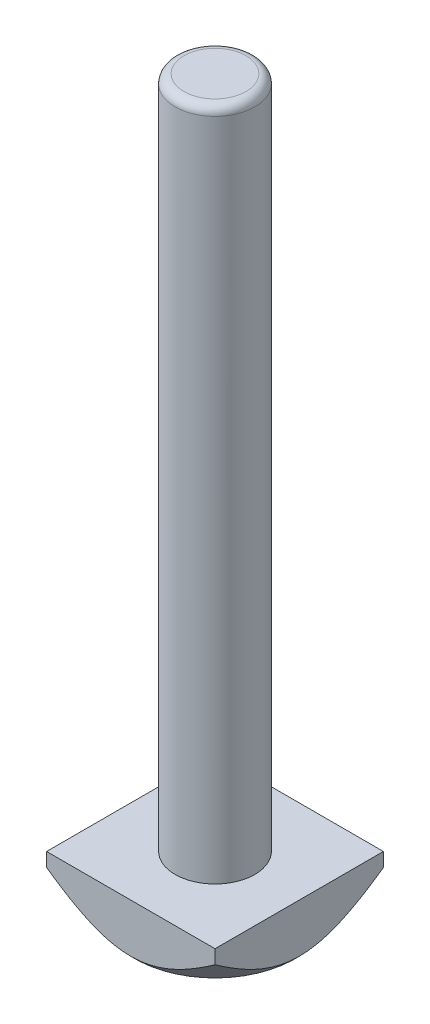
ISO-10303-21;
HEADER;
FILE_DESCRIPTION(('STEP AP214'),'2;1');
FILE_NAME('part.step','',(''),(''),'','','');
FILE_SCHEMA(('AUTOMOTIVE_DESIGN { 1 0 10303 214 1 1 1 1 }'));
ENDSEC;
DATA;
#1=APPLICATION_CONTEXT('core data for automotive mechanical design processes');
#2=APPLICATION_PROTOCOL_DEFINITION('international standard','automotive_design',2000,#1);
#3=PRODUCT_CONTEXT('',#1,'mechanical');
#4=PRODUCT('Part','Part','',(#3));
#5=PRODUCT_RELATED_PRODUCT_CATEGORY('part','',(#4));
#6=PRODUCT_DEFINITION_FORMATION('','',#4);
#7=PRODUCT_DEFINITION_CONTEXT('part definition',#1,'design');
#8=PRODUCT_DEFINITION('design','',#6,#7);
#9=PRODUCT_DEFINITION_SHAPE('','',#8);
#10=(LENGTH_UNIT() NAMED_UNIT(*) SI_UNIT(.MILLI.,.METRE.));
#11=(NAMED_UNIT(*) PLANE_ANGLE_UNIT() SI_UNIT($,.RADIAN.));
#12=(NAMED_UNIT(*) SI_UNIT($,.STERADIAN.) SOLID_ANGLE_UNIT());
#13=UNCERTAINTY_MEASURE_WITH_UNIT(LENGTH_MEASURE(1.E-05),#10,'distance_accuracy_value','');
#14=(GEOMETRIC_REPRESENTATION_CONTEXT(3) GLOBAL_UNCERTAINTY_ASSIGNED_CONTEXT((#13)) GLOBAL_UNIT_ASSIGNED_CONTEXT((#10,
#11,#12)) REPRESENTATION_CONTEXT('',''));
#15=CARTESIAN_POINT('',(0.,0.,0.));
#16=DIRECTION('',(0.,0.,1.));
#17=DIRECTION('',(1.,0.,0.));
#18=AXIS2_PLACEMENT_3D('',#15,#16,#17);
#19=CARTESIAN_POINT('',(9.5,6.,9.5));
#20=DIRECTION('',(-1.,0.,0.));
#21=DIRECTION('',(0.,0.,1.));
#22=AXIS2_PLACEMENT_3D('',#19,#20,#21);
#23=PLANE('',#22);
#24=CARTESIAN_POINT('',(9.5,10.7774490782005,-17.3463970910623));
#25=CARTESIAN_POINT('',(9.5,10.5975235227073,-17.1412528034435));
#26=CARTESIAN_POINT('',(9.5,10.4180114252176,-16.9357459540648));
#27=CARTESIAN_POINT('',(9.5,10.0599049211134,-16.5239319636265));
#28=CARTESIAN_POINT('',(9.5,9.88131052059586,-16.3176248172661));
#29=CARTESIAN_POINT('',(9.5,9.34699660679486,-15.6973397112835));
#30=CARTESIAN_POINT('',(9.5,8.99279391078661,-15.2820521817521));
#31=CARTESIAN_POINT('',(9.5,8.2873400539941,-14.444835558179));
#32=CARTESIAN_POINT('',(9.5,7.9361179991028,-14.0228818948851));
#33=CARTESIAN_POINT('',(9.5,7.24005527863906,-13.1737810139565));
#34=CARTESIAN_POINT('',(9.5,6.8952142114909,-12.7466341259704));
#35=CARTESIAN_POINT('',(9.5,6.18799584270471,-11.8534954442805));
#36=CARTESIAN_POINT('',(9.5,5.82625166843822,-11.3869993506301));
#37=CARTESIAN_POINT('',(9.5,5.29302300724696,-10.6800887363805));
#38=CARTESIAN_POINT('',(9.5,5.11682392489546,-10.4432282978442));
#39=CARTESIAN_POINT('',(9.5,4.76811329066759,-9.9668114746338));
#40=CARTESIAN_POINT('',(9.5,4.59560165123548,-9.72725515417815));
#41=CARTESIAN_POINT('',(9.5,4.25531487242115,-9.24566550538625));
#42=CARTESIAN_POINT('',(9.5,4.08752927652812,-9.00363957852088));
#43=CARTESIAN_POINT('',(9.5,3.75705697596145,-8.51613891786358));
#44=CARTESIAN_POINT('',(9.5,3.59437003777931,-8.27066434276086));
#45=CARTESIAN_POINT('',(9.5,3.27512302217356,-7.77588310711766));
#46=CARTESIAN_POINT('',(9.5,3.11856067455752,-7.52657791511789));
#47=CARTESIAN_POINT('',(9.5,2.81272201149527,-7.02355235915691));
#48=CARTESIAN_POINT('',(9.5,2.66344493915499,-6.76983245758746));
#49=CARTESIAN_POINT('',(9.5,2.42065170956378,-6.34047767182186));
#50=CARTESIAN_POINT('',(9.5,2.32474745062465,-6.16619443785183));
#51=CARTESIAN_POINT('',(9.5,2.13752139517218,-5.81518785728723));
#52=CARTESIAN_POINT('',(9.5,2.04619961555047,-5.63846450170109));
#53=CARTESIAN_POINT('',(9.5,1.77998366105175,-5.10426622450428));
#54=CARTESIAN_POINT('',(9.5,1.6128775370997,-4.74283049644167));
#55=CARTESIAN_POINT('',(9.5,1.30748913632994,-4.01283958487054));
#56=CARTESIAN_POINT('',(9.5,1.16889120676209,-3.64441798304966));
#57=CARTESIAN_POINT('',(9.5,0.925485359360197,-2.89652766976757));
#58=CARTESIAN_POINT('',(9.5,0.820657546566432,-2.51706560677251));
#59=CARTESIAN_POINT('',(9.5,0.675598071067604,-1.85496117328879));
#60=CARTESIAN_POINT('',(9.5,0.625524819505528,-1.57447606134936));
#61=CARTESIAN_POINT('',(9.5,0.549480409060977,-1.01025323962728));
#62=CARTESIAN_POINT('',(9.5,0.523504114158565,-0.72651623600989));
#63=CARTESIAN_POINT('',(9.5,0.497089655743846,-0.158349684494806));
#64=CARTESIAN_POINT('',(9.5,0.496605666961844,0.126077701501812));
#65=CARTESIAN_POINT('',(9.5,0.521078042886076,0.693857484485337));
#66=CARTESIAN_POINT('',(9.5,0.546038787977188,0.977209687946187));
#67=CARTESIAN_POINT('',(9.5,0.627933903825834,1.60052485593543));
#68=CARTESIAN_POINT('',(9.5,0.690528844091517,1.93974243773259));
#69=CARTESIAN_POINT('',(9.5,0.84683305621771,2.61091797565118));
#70=CARTESIAN_POINT('',(9.5,0.94055300937391,2.94287339784706));
#71=CARTESIAN_POINT('',(9.5,1.10136450529838,3.43691021596718));
#72=CARTESIAN_POINT('',(9.5,1.15886748079035,3.60220676582378));
#73=CARTESIAN_POINT('',(9.5,1.2798954611177,3.93059023102045));
#74=CARTESIAN_POINT('',(9.5,1.34342054921749,4.09367711577307));
#75=CARTESIAN_POINT('',(9.5,1.47583803298801,4.4175817752071));
#76=CARTESIAN_POINT('',(9.5,1.5447285820552,4.57840030826605));
#77=CARTESIAN_POINT('',(9.5,1.68731730955084,4.89787389365241));
#78=CARTESIAN_POINT('',(9.5,1.76101524910577,5.0565290530024));
#79=CARTESIAN_POINT('',(9.5,1.99907220641841,5.55131273582962));
#80=CARTESIAN_POINT('',(9.5,2.17108995433861,5.88377020154456));
#81=CARTESIAN_POINT('',(9.5,2.53042794942325,6.5403561312589));
#82=CARTESIAN_POINT('',(9.5,2.71775360385175,6.86448159850823));
#83=CARTESIAN_POINT('',(9.5,3.10465507268264,7.50587522416713));
#84=CARTESIAN_POINT('',(9.5,3.30424641793966,7.82313397119317));
#85=CARTESIAN_POINT('',(9.5,3.71294313394322,8.45137901950514));
#86=CARTESIAN_POINT('',(9.5,3.92204739719235,8.76236604489392));
#87=CARTESIAN_POINT('',(9.5,4.3492561061667,9.38099057764951));
#88=CARTESIAN_POINT('',(9.5,4.56740915392352,9.68859441081414));
#89=CARTESIAN_POINT('',(9.5,5.01000283493081,10.299243191165));
#90=CARTESIAN_POINT('',(9.5,5.23444361820664,10.602288029308));
#91=CARTESIAN_POINT('',(9.5,5.68832181322484,11.2042788770401));
#92=CARTESIAN_POINT('',(9.5,5.91775569517934,11.5032275533695));
#93=CARTESIAN_POINT('',(9.5,6.38089092464594,12.0977890983479));
#94=CARTESIAN_POINT('',(9.5,6.61459222729175,12.3934020020153));
#95=CARTESIAN_POINT('',(9.5,7.26635958725672,13.2076464037298));
#96=CARTESIAN_POINT('',(9.5,7.68821267964728,13.7232462738149));
#97=CARTESIAN_POINT('',(9.5,8.54028259145771,14.7476140660922));
#98=CARTESIAN_POINT('',(9.5,8.97050089602984,15.2563807475111));
#99=CARTESIAN_POINT('',(9.5,9.83157197491884,16.2617502262246));
#100=CARTESIAN_POINT('',(9.5,10.2623409502828,16.7584248896872));
#101=CARTESIAN_POINT('',(9.5,10.9120921801581,17.5001590380037));
#102=CARTESIAN_POINT('',(9.5,11.1292461516682,17.7468245454333));
#103=CARTESIAN_POINT('',(9.5,11.564647058668,18.2391858560405));
#104=CARTESIAN_POINT('',(9.5,11.7828939858197,18.4848816665902));
#105=CARTESIAN_POINT('',(9.5,12.0016265367413,18.7301446120621));
#106=B_SPLINE_CURVE_WITH_KNOTS('',3,(#24,#25,#26,#27,#28,#29,#30,#31,#32,#33,#34,#35,#36,#37,
#38,#39,#40,#41,#42,#43,#44,#45,#46,#47,#48,#49,#50,#51,#52,#53,#54,#55,#56,#57,#58,#59,#60,#61,
#62,#63,#64,#65,#66,#67,#68,#69,#70,#71,#72,#73,#74,#75,#76,#77,#78,#79,#80,#81,#82,#83,#84,#85,
#86,#87,#88,#89,#90,#91,#92,#93,#94,#95,#96,#97,#98,#99,#100,#101,#102,#103,#104,#105),
.UNSPECIFIED.,.F.,.F.,(4,2,2,2,2,2,2,2,2,2,2,2,2,2,2,2,2,2,2,2,2,2,2,2,2,2,2,2,2,2,2,2,2,2,2,2,
2,2,2,2,4),(0.,0.81860546243279,1.63721635636585,3.2746541678231,4.92160571809248,
6.56845326554495,8.33922824382573,9.22483052359889,10.1104117519585,10.993848857297,
11.8772454436511,12.7603114186528,13.6432854525159,14.2400052279579,14.8367272028288,
16.0304039639091,17.2100529309212,18.3890056560121,19.2428440446278,20.096500404479,
20.9486221691344,21.8008906538056,22.8339993312487,23.8674629117299,24.3924069784548,
24.9173583043482,25.4421297520607,25.9668751443367,27.0892671650104,28.2120573801662,
29.3362997999463,30.4604116682865,31.5916408377258,32.7228970213193,33.853377913913,
34.9838469278314,36.9822730137822,38.9810571980236,40.9533804153018,41.9392772984662,
42.9251666718795),.UNSPECIFIED.);
#107=CARTESIAN_POINT('',(9.5,4.43502884254439,-9.5));
#108=VERTEX_POINT('',#107);
#109=CARTESIAN_POINT('',(9.5,4.43502884254439,9.5));
#110=VERTEX_POINT('',#109);
#111=EDGE_CURVE('E48',#108,#110,#106,.T.);
#112=ORIENTED_EDGE('',*,*,#111,.F.);
#113=DIRECTION('',(0.,-1.,0.));
#114=VECTOR('',#113,1.);
#115=CARTESIAN_POINT('',(9.5,6.,-9.5));
#116=LINE('',#115,#114);
#117=CARTESIAN_POINT('',(9.5,6.,-9.5));
#118=VERTEX_POINT('',#117);
#119=EDGE_CURVE('E95',#118,#108,#116,.T.);
#120=ORIENTED_EDGE('',*,*,#119,.F.);
#121=DIRECTION('',(0.,0.,-1.));
#122=VECTOR('',#121,1.);
#123=CARTESIAN_POINT('',(9.5,6.,9.5));
#124=LINE('',#123,#122);
#125=CARTESIAN_POINT('',(9.5,6.,9.5));
#126=VERTEX_POINT('',#125);
#127=EDGE_CURVE('E136',#126,#118,#124,.T.);
#128=ORIENTED_EDGE('',*,*,#127,.F.);
#129=DIRECTION('',(0.,-1.,0.));
#130=VECTOR('',#129,1.);
#131=CARTESIAN_POINT('',(9.5,6.,9.5));
#132=LINE('',#131,#130);
#133=EDGE_CURVE('E93',#126,#110,#132,.T.);
#134=ORIENTED_EDGE('',*,*,#133,.T.);
#135=EDGE_LOOP('',(#112,#120,#128,#134));
#136=FACE_BOUND('',#135,.T.);
#137=ADVANCED_FACE('F33',(#136),#23,.F.);
#138=CARTESIAN_POINT('',(-9.5,6.,-9.5));
#139=DIRECTION('',(0.,0.,1.));
#140=DIRECTION('',(1.,0.,0.));
#141=AXIS2_PLACEMENT_3D('',#138,#139,#140);
#142=PLANE('',#141);
#143=CARTESIAN_POINT('',(-17.3463970910623,10.7774490782005,-9.5));
#144=CARTESIAN_POINT('',(-17.1412528034435,10.5975235227073,-9.5));
#145=CARTESIAN_POINT('',(-16.9357459540648,10.4180114252176,-9.5));
#146=CARTESIAN_POINT('',(-16.5239319636265,10.0599049211135,-9.5));
#147=CARTESIAN_POINT('',(-16.3176248172661,9.88131052059586,-9.5));
#148=CARTESIAN_POINT('',(-15.6973397112835,9.34699660679486,-9.5));
#149=CARTESIAN_POINT('',(-15.2820521817521,8.99279391078661,-9.5));
#150=CARTESIAN_POINT('',(-14.444835558179,8.2873400539941,-9.5));
#151=CARTESIAN_POINT('',(-14.0228818948851,7.9361179991028,-9.5));
#152=CARTESIAN_POINT('',(-13.1737810139565,7.24005527863907,-9.5));
#153=CARTESIAN_POINT('',(-12.7466341259704,6.89521421149091,-9.5));
#154=CARTESIAN_POINT('',(-11.8534954442805,6.18799584270471,-9.5));
#155=CARTESIAN_POINT('',(-11.3869993506301,5.82625166843822,-9.5));
#156=CARTESIAN_POINT('',(-10.6800887363805,5.29302300724697,-9.5));
#157=CARTESIAN_POINT('',(-10.4432282978442,5.11682392489547,-9.5));
#158=CARTESIAN_POINT('',(-9.9668114746338,4.76811329066759,-9.5));
#159=CARTESIAN_POINT('',(-9.72725515417815,4.59560165123548,-9.5));
#160=CARTESIAN_POINT('',(-9.24566550538626,4.25531487242116,-9.5));
#161=CARTESIAN_POINT('',(-9.00363957852088,4.08752927652812,-9.5));
#162=CARTESIAN_POINT('',(-8.51613891786358,3.75705697596145,-9.5));
#163=CARTESIAN_POINT('',(-8.27066434276086,3.59437003777931,-9.5));
#164=CARTESIAN_POINT('',(-7.77588310711766,3.27512302217356,-9.5));
#165=CARTESIAN_POINT('',(-7.52657791511789,3.11856067455752,-9.5));
#166=CARTESIAN_POINT('',(-7.02355235915691,2.81272201149527,-9.5));
#167=CARTESIAN_POINT('',(-6.76983245758746,2.663444939155,-9.5));
#168=CARTESIAN_POINT('',(-6.34047767182186,2.42065170956378,-9.5));
#169=CARTESIAN_POINT('',(-6.16619443785183,2.32474745062466,-9.5));
#170=CARTESIAN_POINT('',(-5.81518785728723,2.13752139517218,-9.5));
#171=CARTESIAN_POINT('',(-5.63846450170109,2.04619961555047,-9.5));
#172=CARTESIAN_POINT('',(-5.10426622450428,1.77998366105175,-9.5));
#173=CARTESIAN_POINT('',(-4.74283049644167,1.61287753709971,-9.5));
#174=CARTESIAN_POINT('',(-4.01283958487054,1.30748913632994,-9.5));
#175=CARTESIAN_POINT('',(-3.64441798304966,1.16889120676209,-9.5));
#176=CARTESIAN_POINT('',(-2.89652766976757,0.925485359360199,-9.5));
#177=CARTESIAN_POINT('',(-2.51706560677251,0.820657546566435,-9.5));
#178=CARTESIAN_POINT('',(-1.8549611732888,0.675598071067608,-9.5));
#179=CARTESIAN_POINT('',(-1.57447606134937,0.625524819505532,-9.5));
#180=CARTESIAN_POINT('',(-1.01025323962728,0.54948040906098,-9.5));
#181=CARTESIAN_POINT('',(-0.726516236009892,0.523504114158568,-9.5));
#182=CARTESIAN_POINT('',(-0.158349684494806,0.497089655743848,-9.5));
#183=CARTESIAN_POINT('',(0.126077701501814,0.496605666961845,-9.5));
#184=CARTESIAN_POINT('',(0.693857484485339,0.521078042886078,-9.5));
#185=CARTESIAN_POINT('',(0.977209687946189,0.546038787977191,-9.5));
#186=CARTESIAN_POINT('',(1.60052485593543,0.627933903825838,-9.5));
#187=CARTESIAN_POINT('',(1.9397424377326,0.690528844091521,-9.5));
#188=CARTESIAN_POINT('',(2.61091797565119,0.846833056217713,-9.5));
#189=CARTESIAN_POINT('',(2.94287339784707,0.940553009373911,-9.5));
#190=CARTESIAN_POINT('',(3.43691021596719,1.10136450529838,-9.5));
#191=CARTESIAN_POINT('',(3.60220676582378,1.15886748079035,-9.5));
#192=CARTESIAN_POINT('',(3.93059023102045,1.27989546111771,-9.5));
#193=CARTESIAN_POINT('',(4.09367711577307,1.34342054921749,-9.5));
#194=CARTESIAN_POINT('',(4.41758177520711,1.47583803298802,-9.5));
#195=CARTESIAN_POINT('',(4.57840030826605,1.54472858205521,-9.5));
#196=CARTESIAN_POINT('',(4.89787389365242,1.68731730955085,-9.5));
#197=CARTESIAN_POINT('',(5.05652905300241,1.76101524910578,-9.5));
#198=CARTESIAN_POINT('',(5.55131273582962,1.99907220641842,-9.5));
#199=CARTESIAN_POINT('',(5.88377020154456,2.17108995433862,-9.5));
#200=CARTESIAN_POINT('',(6.5403561312589,2.53042794942325,-9.5));
#201=CARTESIAN_POINT('',(6.86448159850824,2.71775360385176,-9.5));
#202=CARTESIAN_POINT('',(7.50587522416713,3.10465507268264,-9.5));
#203=CARTESIAN_POINT('',(7.82313397119317,3.30424641793966,-9.5));
#204=CARTESIAN_POINT('',(8.45137901950514,3.71294313394322,-9.5));
#205=CARTESIAN_POINT('',(8.76236604489392,3.92204739719235,-9.5));
#206=CARTESIAN_POINT('',(9.38099057764951,4.3492561061667,-9.5));
#207=CARTESIAN_POINT('',(9.68859441081414,4.56740915392352,-9.5));
#208=CARTESIAN_POINT('',(10.299243191165,5.01000283493081,-9.5));
#209=CARTESIAN_POINT('',(10.602288029308,5.23444361820665,-9.5));
#210=CARTESIAN_POINT('',(11.2042788770401,5.68832181322485,-9.5));
#211=CARTESIAN_POINT('',(11.5032275533695,5.91775569517935,-9.5));
#212=CARTESIAN_POINT('',(12.0977890983479,6.38089092464594,-9.5));
#213=CARTESIAN_POINT('',(12.3934020020153,6.61459222729175,-9.5));
#214=CARTESIAN_POINT('',(13.2076464037298,7.26635958725672,-9.5));
#215=CARTESIAN_POINT('',(13.7232462738149,7.68821267964729,-9.5));
#216=CARTESIAN_POINT('',(14.7476140660922,8.54028259145772,-9.5));
#217=CARTESIAN_POINT('',(15.2563807475111,8.97050089602985,-9.5));
#218=CARTESIAN_POINT('',(16.2617502262246,9.83157197491885,-9.5));
#219=CARTESIAN_POINT('',(16.7584248896872,10.2623409502828,-9.5));
#220=CARTESIAN_POINT('',(17.5001590380037,10.9120921801581,-9.5));
#221=CARTESIAN_POINT('',(17.7468245454333,11.1292461516682,-9.5));
#222=CARTESIAN_POINT('',(18.2391858560405,11.564647058668,-9.5));
#223=CARTESIAN_POINT('',(18.4848816665902,11.7828939858198,-9.5));
#224=CARTESIAN_POINT('',(18.7301446120621,12.0016265367413,-9.5));
#225=B_SPLINE_CURVE_WITH_KNOTS('',3,(#143,#144,#145,#146,#147,#148,#149,#150,#151,#152,#153,
#154,#155,#156,#157,#158,#159,#160,#161,#162,#163,#164,#165,#166,#167,#168,#169,#170,#171,#172,
#173,#174,#175,#176,#177,#178,#179,#180,#181,#182,#183,#184,#185,#186,#187,#188,#189,#190,#191,
#192,#193,#194,#195,#196,#197,#198,#199,#200,#201,#202,#203,#204,#205,#206,#207,#208,#209,#210,
#211,#212,#213,#214,#215,#216,#217,#218,#219,#220,#221,#222,#223,#224),.UNSPECIFIED.,.F.,.F.,(4,
2,2,2,2,2,2,2,2,2,2,2,2,2,2,2,2,2,2,2,2,2,2,2,2,2,2,2,2,2,2,2,2,2,2,2,2,2,2,2,4),(0.,
0.818605462432792,1.63721635636585,3.27465416782311,4.92160571809249,6.56845326554495,
8.33922824382573,9.22483052359889,10.1104117519585,10.993848857297,11.8772454436511,
12.7603114186528,13.6432854525159,14.2400052279579,14.8367272028288,16.0304039639091,
17.2100529309212,18.3890056560121,19.2428440446278,20.096500404479,20.9486221691344,
21.8008906538056,22.8339993312487,23.8674629117299,24.3924069784548,24.9173583043482,
25.4421297520607,25.9668751443367,27.0892671650104,28.2120573801662,29.3362997999463,
30.4604116682865,31.5916408377258,32.7228970213193,33.853377913913,34.9838469278314,
36.9822730137822,38.9810571980236,40.9533804153018,41.9392772984662,42.9251666718795),.UNSPECIFIED.);
#226=CARTESIAN_POINT('',(-9.5,4.43502884254439,-9.5));
#227=VERTEX_POINT('',#226);
#228=EDGE_CURVE('E90',#227,#108,#225,.T.);
#229=ORIENTED_EDGE('',*,*,#228,.F.);
#230=DIRECTION('',(0.,-1.,0.));
#231=VECTOR('',#230,1.);
#232=CARTESIAN_POINT('',(-9.5,6.,-9.5));
#233=LINE('',#232,#231);
#234=CARTESIAN_POINT('',(-9.5,6.,-9.5));
#235=VERTEX_POINT('',#234);
#236=EDGE_CURVE('E89',#235,#227,#233,.T.);
#237=ORIENTED_EDGE('',*,*,#236,.F.);
#238=DIRECTION('',(-1.,0.,0.));
#239=VECTOR('',#238,1.);
#240=CARTESIAN_POINT('',(-9.5,6.,-9.5));
#241=LINE('',#240,#239);
#242=EDGE_CURVE('E175',#118,#235,#241,.T.);
#243=ORIENTED_EDGE('',*,*,#242,.F.);
#244=ORIENTED_EDGE('',*,*,#119,.T.);
#245=EDGE_LOOP('',(#229,#237,#243,#244));
#246=FACE_BOUND('',#245,.T.);
#247=ADVANCED_FACE('F119',(#246),#142,.F.);
#248=CARTESIAN_POINT('',(-9.5,6.,9.5));
#249=DIRECTION('',(1.,0.,0.));
#250=DIRECTION('',(0.,0.,-1.));
#251=AXIS2_PLACEMENT_3D('',#248,#249,#250);
#252=PLANE('',#251);
#253=CARTESIAN_POINT('',(-9.5,10.7774490782005,-17.3463970910623));
#254=CARTESIAN_POINT('',(-9.5,10.5975235227073,-17.1412528034435));
#255=CARTESIAN_POINT('',(-9.5,10.4180114252176,-16.9357459540648));
#256=CARTESIAN_POINT('',(-9.5,10.0599049211135,-16.5239319636265));
#257=CARTESIAN_POINT('',(-9.5,9.88131052059586,-16.3176248172661));
#258=CARTESIAN_POINT('',(-9.5,9.34699660679486,-15.6973397112835));
#259=CARTESIAN_POINT('',(-9.5,8.99279391078661,-15.2820521817521));
#260=CARTESIAN_POINT('',(-9.5,8.2873400539941,-14.444835558179));
#261=CARTESIAN_POINT('',(-9.5,7.9361179991028,-14.0228818948851));
#262=CARTESIAN_POINT('',(-9.5,7.24005527863907,-13.1737810139565));
#263=CARTESIAN_POINT('',(-9.5,6.8952142114909,-12.7466341259704));
#264=CARTESIAN_POINT('',(-9.5,6.18799584270471,-11.8534954442805));
#265=CARTESIAN_POINT('',(-9.5,5.82625166843822,-11.3869993506301));
#266=CARTESIAN_POINT('',(-9.5,5.29302300724696,-10.6800887363805));
#267=CARTESIAN_POINT('',(-9.5,5.11682392489547,-10.4432282978442));
#268=CARTESIAN_POINT('',(-9.5,4.76811329066759,-9.9668114746338));
#269=CARTESIAN_POINT('',(-9.5,4.59560165123548,-9.72725515417815));
#270=CARTESIAN_POINT('',(-9.5,4.25531487242116,-9.24566550538625));
#271=CARTESIAN_POINT('',(-9.5,4.08752927652812,-9.00363957852088));
#272=CARTESIAN_POINT('',(-9.5,3.75705697596145,-8.51613891786357));
#273=CARTESIAN_POINT('',(-9.5,3.59437003777931,-8.27066434276086));
#274=CARTESIAN_POINT('',(-9.5,3.27512302217356,-7.77588310711766));
#275=CARTESIAN_POINT('',(-9.5,3.11856067455752,-7.52657791511789));
#276=CARTESIAN_POINT('',(-9.5,2.81272201149527,-7.02355235915691));
#277=CARTESIAN_POINT('',(-9.5,2.663444939155,-6.76983245758745));
#278=CARTESIAN_POINT('',(-9.5,2.42065170956378,-6.34047767182186));
#279=CARTESIAN_POINT('',(-9.5,2.32474745062466,-6.16619443785183));
#280=CARTESIAN_POINT('',(-9.5,2.13752139517218,-5.81518785728722));
#281=CARTESIAN_POINT('',(-9.5,2.04619961555047,-5.63846450170109));
#282=CARTESIAN_POINT('',(-9.5,1.77998366105175,-5.10426622450428));
#283=CARTESIAN_POINT('',(-9.5,1.61287753709971,-4.74283049644167));
#284=CARTESIAN_POINT('',(-9.5,1.30748913632994,-4.01283958487054));
#285=CARTESIAN_POINT('',(-9.5,1.16889120676209,-3.64441798304965));
#286=CARTESIAN_POINT('',(-9.5,0.925485359360201,-2.89652766976756));
#287=CARTESIAN_POINT('',(-9.5,0.820657546566435,-2.51706560677251));
#288=CARTESIAN_POINT('',(-9.5,0.675598071067608,-1.85496117328879));
#289=CARTESIAN_POINT('',(-9.5,0.625524819505532,-1.57447606134936));
#290=CARTESIAN_POINT('',(-9.5,0.549480409060981,-1.01025323962728));
#291=CARTESIAN_POINT('',(-9.5,0.523504114158569,-0.726516236009888));
#292=CARTESIAN_POINT('',(-9.5,0.49708965574385,-0.158349684494802));
#293=CARTESIAN_POINT('',(-9.5,0.496605666961847,0.126077701501817));
#294=CARTESIAN_POINT('',(-9.5,0.521078042886079,0.693857484485341));
#295=CARTESIAN_POINT('',(-9.5,0.546038787977191,0.97720968794619));
#296=CARTESIAN_POINT('',(-9.5,0.627933903825838,1.60052485593543));
#297=CARTESIAN_POINT('',(-9.5,0.690528844091522,1.9397424377326));
#298=CARTESIAN_POINT('',(-9.5,0.846833056217715,2.61091797565119));
#299=CARTESIAN_POINT('',(-9.5,0.940553009373913,2.94287339784707));
#300=CARTESIAN_POINT('',(-9.5,1.10136450529838,3.43691021596719));
#301=CARTESIAN_POINT('',(-9.5,1.15886748079035,3.60220676582379));
#302=CARTESIAN_POINT('',(-9.5,1.27989546111771,3.93059023102046));
#303=CARTESIAN_POINT('',(-9.5,1.34342054921749,4.09367711577307));
#304=CARTESIAN_POINT('',(-9.5,1.47583803298802,4.41758177520711));
#305=CARTESIAN_POINT('',(-9.5,1.54472858205521,4.57840030826606));
#306=CARTESIAN_POINT('',(-9.5,1.68731730955085,4.89787389365242));
#307=CARTESIAN_POINT('',(-9.5,1.76101524910578,5.05652905300241));
#308=CARTESIAN_POINT('',(-9.5,1.99907220641842,5.55131273582962));
#309=CARTESIAN_POINT('',(-9.5,2.17108995433862,5.88377020154456));
#310=CARTESIAN_POINT('',(-9.5,2.53042794942326,6.5403561312589));
#311=CARTESIAN_POINT('',(-9.5,2.71775360385176,6.86448159850824));
#312=CARTESIAN_POINT('',(-9.5,3.10465507268264,7.50587522416714));
#313=CARTESIAN_POINT('',(-9.5,3.30424641793967,7.82313397119317));
#314=CARTESIAN_POINT('',(-9.5,3.71294313394323,8.45137901950514));
#315=CARTESIAN_POINT('',(-9.5,3.92204739719236,8.76236604489393));
#316=CARTESIAN_POINT('',(-9.5,4.34925610616671,9.38099057764952));
#317=CARTESIAN_POINT('',(-9.5,4.56740915392353,9.68859441081415));
#318=CARTESIAN_POINT('',(-9.5,5.01000283493082,10.299243191165));
#319=CARTESIAN_POINT('',(-9.5,5.23444361820666,10.602288029308));
#320=CARTESIAN_POINT('',(-9.5,5.68832181322486,11.2042788770401));
#321=CARTESIAN_POINT('',(-9.5,5.91775569517936,11.5032275533695));
#322=CARTESIAN_POINT('',(-9.5,6.38089092464595,12.0977890983479));
#323=CARTESIAN_POINT('',(-9.5,6.61459222729176,12.3934020020153));
#324=CARTESIAN_POINT('',(-9.5,7.26635958725673,13.2076464037298));
#325=CARTESIAN_POINT('',(-9.5,7.68821267964729,13.7232462738149));
#326=CARTESIAN_POINT('',(-9.5,8.54028259145772,14.7476140660922));
#327=CARTESIAN_POINT('',(-9.5,8.97050089602985,15.2563807475111));
#328=CARTESIAN_POINT('',(-9.5,9.83157197491885,16.2617502262246));
#329=CARTESIAN_POINT('',(-9.5,10.2623409502828,16.7584248896872));
#330=CARTESIAN_POINT('',(-9.5,10.9120921801581,17.5001590380037));
#331=CARTESIAN_POINT('',(-9.5,11.1292461516682,17.7468245454333));
#332=CARTESIAN_POINT('',(-9.5,11.564647058668,18.2391858560405));
#333=CARTESIAN_POINT('',(-9.5,11.7828939858198,18.4848816665902));
#334=CARTESIAN_POINT('',(-9.5,12.0016265367413,18.7301446120621));
#335=B_SPLINE_CURVE_WITH_KNOTS('',3,(#253,#254,#255,#256,#257,#258,#259,#260,#261,#262,#263,
#264,#265,#266,#267,#268,#269,#270,#271,#272,#273,#274,#275,#276,#277,#278,#279,#280,#281,#282,
#283,#284,#285,#286,#287,#288,#289,#290,#291,#292,#293,#294,#295,#296,#297,#298,#299,#300,#301,
#302,#303,#304,#305,#306,#307,#308,#309,#310,#311,#312,#313,#314,#315,#316,#317,#318,#319,#320,
#321,#322,#323,#324,#325,#326,#327,#328,#329,#330,#331,#332,#333,#334),.UNSPECIFIED.,.F.,.F.,(4,
2,2,2,2,2,2,2,2,2,2,2,2,2,2,2,2,2,2,2,2,2,2,2,2,2,2,2,2,2,2,2,2,2,2,2,2,2,2,2,4),(0.,
0.818605462432792,1.63721635636585,3.27465416782311,4.92160571809249,6.56845326554495,
8.33922824382573,9.22483052359889,10.1104117519585,10.993848857297,11.8772454436511,
12.7603114186528,13.6432854525159,14.2400052279579,14.8367272028288,16.0304039639091,
17.2100529309212,18.3890056560121,19.2428440446278,20.096500404479,20.9486221691344,
21.8008906538056,22.8339993312487,23.8674629117299,24.3924069784548,24.9173583043482,
25.4421297520608,25.9668751443367,27.0892671650104,28.2120573801662,29.3362997999463,
30.4604116682866,31.5916408377258,32.7228970213193,33.853377913913,34.9838469278314,
36.9822730137822,38.9810571980236,40.9533804153018,41.9392772984662,42.9251666718795),.UNSPECIFIED.);
#336=CARTESIAN_POINT('',(-9.5,4.43502884254439,9.5));
#337=VERTEX_POINT('',#336);
#338=EDGE_CURVE('E75',#337,#227,#335,.F.);
#339=ORIENTED_EDGE('',*,*,#338,.F.);
#340=DIRECTION('',(0.,-1.,0.));
#341=VECTOR('',#340,1.);
#342=CARTESIAN_POINT('',(-9.5,6.,9.5));
#343=LINE('',#342,#341);
#344=CARTESIAN_POINT('',(-9.5,6.,9.5));
#345=VERTEX_POINT('',#344);
#346=EDGE_CURVE('E87',#345,#337,#343,.T.);
#347=ORIENTED_EDGE('',*,*,#346,.F.);
#348=DIRECTION('',(0.,0.,1.));
#349=VECTOR('',#348,1.);
#350=CARTESIAN_POINT('',(-9.5,6.,9.5));
#351=LINE('',#350,#349);
#352=EDGE_CURVE('E176',#235,#345,#351,.T.);
#353=ORIENTED_EDGE('',*,*,#352,.F.);
#354=ORIENTED_EDGE('',*,*,#236,.T.);
#355=EDGE_LOOP('',(#339,#347,#353,#354));
#356=FACE_BOUND('',#355,.T.);
#357=ADVANCED_FACE('F85',(#356),#252,.F.);
#358=CARTESIAN_POINT('',(-9.5,6.,9.5));
#359=DIRECTION('',(0.,0.,-1.));
#360=DIRECTION('',(-1.,0.,0.));
#361=AXIS2_PLACEMENT_3D('',#358,#359,#360);
#362=PLANE('',#361);
#363=CARTESIAN_POINT('',(-17.3463970910623,10.7774490782005,9.5));
#364=CARTESIAN_POINT('',(-17.1412528034435,10.5975235227073,9.5));
#365=CARTESIAN_POINT('',(-16.9357459540648,10.4180114252176,9.5));
#366=CARTESIAN_POINT('',(-16.5239319636265,10.0599049211135,9.5));
#367=CARTESIAN_POINT('',(-16.3176248172661,9.88131052059586,9.5));
#368=CARTESIAN_POINT('',(-15.6973397112835,9.34699660679486,9.5));
#369=CARTESIAN_POINT('',(-15.2820521817521,8.99279391078661,9.5));
#370=CARTESIAN_POINT('',(-14.444835558179,8.2873400539941,9.5));
#371=CARTESIAN_POINT('',(-14.0228818948851,7.9361179991028,9.5));
#372=CARTESIAN_POINT('',(-13.1737810139565,7.24005527863907,9.5));
#373=CARTESIAN_POINT('',(-12.7466341259704,6.89521421149091,9.5));
#374=CARTESIAN_POINT('',(-11.8534954442805,6.18799584270471,9.5));
#375=CARTESIAN_POINT('',(-11.3869993506301,5.82625166843822,9.5));
#376=CARTESIAN_POINT('',(-10.6800887363805,5.29302300724697,9.5));
#377=CARTESIAN_POINT('',(-10.4432282978442,5.11682392489547,9.5));
#378=CARTESIAN_POINT('',(-9.9668114746338,4.76811329066759,9.5));
#379=CARTESIAN_POINT('',(-9.72725515417815,4.59560165123548,9.5));
#380=CARTESIAN_POINT('',(-9.24566550538626,4.25531487242116,9.5));
#381=CARTESIAN_POINT('',(-9.00363957852088,4.08752927652812,9.5));
#382=CARTESIAN_POINT('',(-8.51613891786358,3.75705697596145,9.5));
#383=CARTESIAN_POINT('',(-8.27066434276086,3.59437003777931,9.5));
#384=CARTESIAN_POINT('',(-7.77588310711766,3.27512302217356,9.5));
#385=CARTESIAN_POINT('',(-7.52657791511789,3.11856067455752,9.5));
#386=CARTESIAN_POINT('',(-7.02355235915691,2.81272201149527,9.5));
#387=CARTESIAN_POINT('',(-6.76983245758746,2.663444939155,9.5));
#388=CARTESIAN_POINT('',(-6.34047767182186,2.42065170956378,9.5));
#389=CARTESIAN_POINT('',(-6.16619443785183,2.32474745062466,9.5));
#390=CARTESIAN_POINT('',(-5.81518785728723,2.13752139517218,9.5));
#391=CARTESIAN_POINT('',(-5.63846450170109,2.04619961555047,9.5));
#392=CARTESIAN_POINT('',(-5.10426622450428,1.77998366105175,9.5));
#393=CARTESIAN_POINT('',(-4.74283049644167,1.61287753709971,9.5));
#394=CARTESIAN_POINT('',(-4.01283958487054,1.30748913632994,9.5));
#395=CARTESIAN_POINT('',(-3.64441798304966,1.16889120676209,9.5));
#396=CARTESIAN_POINT('',(-2.89652766976757,0.925485359360199,9.5));
#397=CARTESIAN_POINT('',(-2.51706560677251,0.820657546566435,9.5));
#398=CARTESIAN_POINT('',(-1.8549611732888,0.675598071067608,9.5));
#399=CARTESIAN_POINT('',(-1.57447606134937,0.625524819505532,9.5));
#400=CARTESIAN_POINT('',(-1.01025323962728,0.54948040906098,9.5));
#401=CARTESIAN_POINT('',(-0.726516236009892,0.523504114158568,9.5));
#402=CARTESIAN_POINT('',(-0.158349684494806,0.497089655743848,9.5));
#403=CARTESIAN_POINT('',(0.126077701501814,0.496605666961845,9.5));
#404=CARTESIAN_POINT('',(0.693857484485339,0.521078042886078,9.5));
#405=CARTESIAN_POINT('',(0.977209687946189,0.546038787977191,9.5));
#406=CARTESIAN_POINT('',(1.60052485593543,0.627933903825838,9.5));
#407=CARTESIAN_POINT('',(1.9397424377326,0.690528844091521,9.5));
#408=CARTESIAN_POINT('',(2.61091797565119,0.846833056217713,9.5));
#409=CARTESIAN_POINT('',(2.94287339784707,0.940553009373911,9.5));
#410=CARTESIAN_POINT('',(3.43691021596719,1.10136450529838,9.5));
#411=CARTESIAN_POINT('',(3.60220676582378,1.15886748079035,9.5));
#412=CARTESIAN_POINT('',(3.93059023102045,1.27989546111771,9.5));
#413=CARTESIAN_POINT('',(4.09367711577307,1.34342054921749,9.5));
#414=CARTESIAN_POINT('',(4.41758177520711,1.47583803298802,9.5));
#415=CARTESIAN_POINT('',(4.57840030826605,1.54472858205521,9.5));
#416=CARTESIAN_POINT('',(4.89787389365242,1.68731730955085,9.5));
#417=CARTESIAN_POINT('',(5.05652905300241,1.76101524910578,9.5));
#418=CARTESIAN_POINT('',(5.55131273582962,1.99907220641842,9.5));
#419=CARTESIAN_POINT('',(5.88377020154456,2.17108995433862,9.5));
#420=CARTESIAN_POINT('',(6.5403561312589,2.53042794942325,9.5));
#421=CARTESIAN_POINT('',(6.86448159850824,2.71775360385176,9.5));
#422=CARTESIAN_POINT('',(7.50587522416713,3.10465507268264,9.5));
#423=CARTESIAN_POINT('',(7.82313397119317,3.30424641793966,9.5));
#424=CARTESIAN_POINT('',(8.45137901950514,3.71294313394322,9.5));
#425=CARTESIAN_POINT('',(8.76236604489392,3.92204739719235,9.5));
#426=CARTESIAN_POINT('',(9.38099057764951,4.3492561061667,9.5));
#427=CARTESIAN_POINT('',(9.68859441081414,4.56740915392352,9.5));
#428=CARTESIAN_POINT('',(10.299243191165,5.01000283493081,9.5));
#429=CARTESIAN_POINT('',(10.602288029308,5.23444361820665,9.5));
#430=CARTESIAN_POINT('',(11.2042788770401,5.68832181322485,9.5));
#431=CARTESIAN_POINT('',(11.5032275533695,5.91775569517935,9.5));
#432=CARTESIAN_POINT('',(12.0977890983479,6.38089092464594,9.5));
#433=CARTESIAN_POINT('',(12.3934020020153,6.61459222729175,9.5));
#434=CARTESIAN_POINT('',(13.2076464037298,7.26635958725672,9.5));
#435=CARTESIAN_POINT('',(13.7232462738149,7.68821267964729,9.5));
#436=CARTESIAN_POINT('',(14.7476140660922,8.54028259145772,9.5));
#437=CARTESIAN_POINT('',(15.2563807475111,8.97050089602985,9.5));
#438=CARTESIAN_POINT('',(16.2617502262246,9.83157197491885,9.5));
#439=CARTESIAN_POINT('',(16.7584248896872,10.2623409502828,9.5));
#440=CARTESIAN_POINT('',(17.5001590380037,10.9120921801581,9.5));
#441=CARTESIAN_POINT('',(17.7468245454333,11.1292461516682,9.5));
#442=CARTESIAN_POINT('',(18.2391858560405,11.564647058668,9.5));
#443=CARTESIAN_POINT('',(18.4848816665902,11.7828939858198,9.5));
#444=CARTESIAN_POINT('',(18.7301446120621,12.0016265367413,9.5));
#445=B_SPLINE_CURVE_WITH_KNOTS('',3,(#363,#364,#365,#366,#367,#368,#369,#370,#371,#372,#373,
#374,#375,#376,#377,#378,#379,#380,#381,#382,#383,#384,#385,#386,#387,#388,#389,#390,#391,#392,
#393,#394,#395,#396,#397,#398,#399,#400,#401,#402,#403,#404,#405,#406,#407,#408,#409,#410,#411,
#412,#413,#414,#415,#416,#417,#418,#419,#420,#421,#422,#423,#424,#425,#426,#427,#428,#429,#430,
#431,#432,#433,#434,#435,#436,#437,#438,#439,#440,#441,#442,#443,#444),.UNSPECIFIED.,.F.,.F.,(4,
2,2,2,2,2,2,2,2,2,2,2,2,2,2,2,2,2,2,2,2,2,2,2,2,2,2,2,2,2,2,2,2,2,2,2,2,2,2,2,4),(0.,
0.818605462432792,1.63721635636585,3.27465416782311,4.92160571809249,6.56845326554495,
8.33922824382573,9.22483052359889,10.1104117519585,10.993848857297,11.8772454436511,
12.7603114186528,13.6432854525159,14.2400052279579,14.8367272028288,16.0304039639091,
17.2100529309212,18.3890056560121,19.2428440446278,20.096500404479,20.9486221691344,
21.8008906538056,22.8339993312487,23.8674629117299,24.3924069784548,24.9173583043482,
25.4421297520607,25.9668751443367,27.0892671650104,28.2120573801662,29.3362997999463,
30.4604116682865,31.5916408377258,32.7228970213193,33.853377913913,34.9838469278314,
36.9822730137822,38.9810571980236,40.9533804153018,41.9392772984662,42.9251666718795),.UNSPECIFIED.);
#446=EDGE_CURVE('E72',#110,#337,#445,.F.);
#447=ORIENTED_EDGE('',*,*,#446,.F.);
#448=ORIENTED_EDGE('',*,*,#133,.F.);
#449=DIRECTION('',(1.,0.,0.));
#450=VECTOR('',#449,1.);
#451=CARTESIAN_POINT('',(-9.5,6.,9.5));
#452=LINE('',#451,#450);
#453=EDGE_CURVE('E56',#345,#126,#452,.T.);
#454=ORIENTED_EDGE('',*,*,#453,.F.);
#455=ORIENTED_EDGE('',*,*,#346,.T.);
#456=EDGE_LOOP('',(#447,#448,#454,#455));
#457=FACE_BOUND('',#456,.T.);
#458=ADVANCED_FACE('F92',(#457),#362,.F.);
#459=CARTESIAN_POINT('',(0.,6.,0.));
#460=DIRECTION('',(0.,-1.,0.));
#461=DIRECTION('',(0.,0.,-1.));
#462=AXIS2_PLACEMENT_3D('',#459,#460,#461);
#463=PLANE('',#462);
#464=CARTESIAN_POINT('',(0.,6.00000000000001,0.));
#465=DIRECTION('',(0.,-1.,0.));
#466=DIRECTION('',(0.,0.,-1.));
#467=AXIS2_PLACEMENT_3D('',#464,#465,#466);
#468=CIRCLE('',#467,4.5);
#469=CARTESIAN_POINT('',(0.,6.00000000000001,-4.5));
#470=VERTEX_POINT('',#469);
#471=EDGE_CURVE('E102',#470,#470,#468,.F.);
#472=ORIENTED_EDGE('',*,*,#471,.F.);
#473=EDGE_LOOP('',(#472));
#474=FACE_BOUND('',#473,.T.);
#475=ORIENTED_EDGE('',*,*,#127,.T.);
#476=ORIENTED_EDGE('',*,*,#242,.T.);
#477=ORIENTED_EDGE('',*,*,#352,.T.);
#478=ORIENTED_EDGE('',*,*,#453,.T.);
#479=EDGE_LOOP('',(#475,#476,#477,#478));
#480=FACE_BOUND('',#479,.T.);
#481=ADVANCED_FACE('F161',(#474,#480),#463,.F.);
#482=CARTESIAN_POINT('',(0.,82.,0.));
#483=DIRECTION('',(0.,-1.,0.));
#484=DIRECTION('',(0.,0.,-1.));
#485=AXIS2_PLACEMENT_3D('',#482,#483,#484);
#486=CYLINDRICAL_SURFACE('',#485,4.5);
#487=CARTESIAN_POINT('',(0.,81.,0.));
#488=DIRECTION('',(0.,1.,0.));
#489=DIRECTION('',(0.,0.,1.));
#490=AXIS2_PLACEMENT_3D('',#487,#488,#489);
#491=CIRCLE('',#490,4.5);
#492=CARTESIAN_POINT('',(0.,81.,4.5));
#493=VERTEX_POINT('',#492);
#494=EDGE_CURVE('E12',#493,#493,#491,.F.);
#495=ORIENTED_EDGE('',*,*,#494,.T.);
#496=EDGE_LOOP('',(#495));
#497=FACE_BOUND('',#496,.T.);
#498=ORIENTED_EDGE('',*,*,#471,.T.);
#499=EDGE_LOOP('',(#498));
#500=FACE_BOUND('',#499,.T.);
#501=ADVANCED_FACE('F164',(#497,#500),#486,.T.);
#502=CARTESIAN_POINT('',(0.,82.,0.));
#503=DIRECTION('',(0.,1.,0.));
#504=DIRECTION('',(0.,0.,1.));
#505=AXIS2_PLACEMENT_3D('',#502,#503,#504);
#506=PLANE('',#505);
#507=CARTESIAN_POINT('',(0.,82.,0.));
#508=DIRECTION('',(0.,1.,0.));
#509=DIRECTION('',(0.,0.,1.));
#510=AXIS2_PLACEMENT_3D('',#507,#508,#509);
#511=CIRCLE('',#510,3.5);
#512=CARTESIAN_POINT('',(0.,82.,3.5));
#513=VERTEX_POINT('',#512);
#514=EDGE_CURVE('E41',#513,#513,#511,.T.);
#515=ORIENTED_EDGE('',*,*,#514,.T.);
#516=EDGE_LOOP('',(#515));
#517=FACE_BOUND('',#516,.T.);
#518=ADVANCED_FACE('F107',(#517),#506,.T.);
#519=CARTESIAN_POINT('',(0.,0.,0.));
#520=DIRECTION('',(0.,1.,0.));
#521=DIRECTION('',(0.,0.,-1.));
#522=AXIS2_PLACEMENT_3D('',#519,#520,#521);
#523=CONICAL_SURFACE('',#522,9.,0.78539816339745);
#524=CARTESIAN_POINT('',(0.,0.,0.));
#525=DIRECTION('',(0.,-1.,0.));
#526=DIRECTION('',(0.,0.,-1.));
#527=AXIS2_PLACEMENT_3D('',#524,#525,#526);
#528=CIRCLE('',#527,9.);
#529=CARTESIAN_POINT('',(0.,0.,-9.));
#530=VERTEX_POINT('',#529);
#531=EDGE_CURVE('E80',#530,#530,#528,.T.);
#532=ORIENTED_EDGE('',*,*,#531,.F.);
#533=EDGE_LOOP('',(#532));
#534=FACE_BOUND('',#533,.T.);
#535=ORIENTED_EDGE('',*,*,#111,.T.);
#536=ORIENTED_EDGE('',*,*,#446,.T.);
#537=ORIENTED_EDGE('',*,*,#338,.T.);
#538=ORIENTED_EDGE('',*,*,#228,.T.);
#539=EDGE_LOOP('',(#535,#536,#537,#538));
#540=FACE_BOUND('',#539,.T.);
#541=ADVANCED_FACE('F74',(#534,#540),#523,.T.);
#542=CARTESIAN_POINT('',(0.,0.,0.));
#543=DIRECTION('',(0.,-1.,0.));
#544=DIRECTION('',(0.,0.,-1.));
#545=AXIS2_PLACEMENT_3D('',#542,#543,#544);
#546=PLANE('',#545);
#547=ORIENTED_EDGE('',*,*,#531,.T.);
#548=EDGE_LOOP('',(#547));
#549=FACE_BOUND('',#548,.T.);
#550=ADVANCED_FACE('F110',(#549),#546,.T.);
#551=CARTESIAN_POINT('',(0.,81.,0.));
#552=DIRECTION('',(0.,1.,0.));
#553=DIRECTION('',(0.,0.,1.));
#554=AXIS2_PLACEMENT_3D('',#551,#552,#553);
#555=TOROIDAL_SURFACE('',#554,3.5,1.);
#556=ORIENTED_EDGE('',*,*,#494,.F.);
#557=EDGE_LOOP('',(#556));
#558=FACE_BOUND('',#557,.T.);
#559=ORIENTED_EDGE('',*,*,#514,.F.);
#560=EDGE_LOOP('',(#559));
#561=FACE_BOUND('',#560,.T.);
#562=ADVANCED_FACE('F35',(#558,#561),#555,.T.);
#563=CLOSED_SHELL('',(#137,#247,#357,#458,#481,#501,#518,#541,#550,#562));
#564=MANIFOLD_SOLID_BREP('B2',#563);
#565=ADVANCED_BREP_SHAPE_REPRESENTATION('',(#18,#564),#14);
#566=SHAPE_DEFINITION_REPRESENTATION(#9,#565);
ENDSEC;
END-ISO-10303-21;
